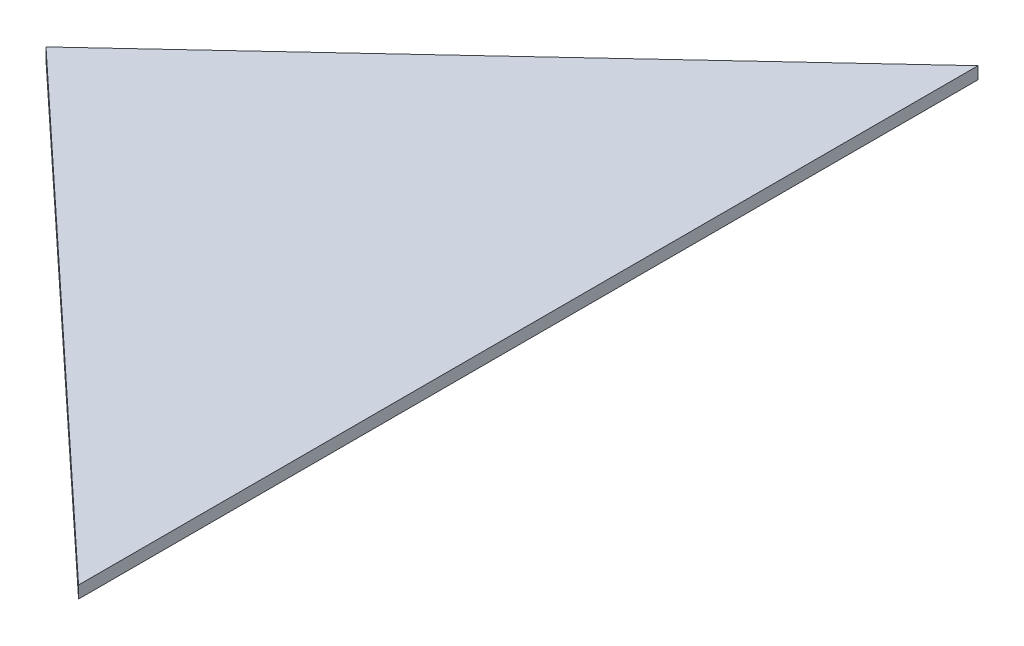
ISO-10303-21;
HEADER;
FILE_DESCRIPTION(('STEP AP214'),'2;1');
FILE_NAME('part.step','',(''),(''),'','','');
FILE_SCHEMA(('AUTOMOTIVE_DESIGN { 1 0 10303 214 1 1 1 1 }'));
ENDSEC;
DATA;
#1=APPLICATION_CONTEXT('core data for automotive mechanical design processes');
#2=APPLICATION_PROTOCOL_DEFINITION('international standard','automotive_design',2000,#1);
#3=PRODUCT_CONTEXT('',#1,'mechanical');
#4=PRODUCT('Part','Part','',(#3));
#5=PRODUCT_RELATED_PRODUCT_CATEGORY('part','',(#4));
#6=PRODUCT_DEFINITION_FORMATION('','',#4);
#7=PRODUCT_DEFINITION_CONTEXT('part definition',#1,'design');
#8=PRODUCT_DEFINITION('design','',#6,#7);
#9=PRODUCT_DEFINITION_SHAPE('','',#8);
#10=(LENGTH_UNIT() NAMED_UNIT(*) SI_UNIT(.MILLI.,.METRE.));
#11=(NAMED_UNIT(*) PLANE_ANGLE_UNIT() SI_UNIT($,.RADIAN.));
#12=(NAMED_UNIT(*) SI_UNIT($,.STERADIAN.) SOLID_ANGLE_UNIT());
#13=UNCERTAINTY_MEASURE_WITH_UNIT(LENGTH_MEASURE(1.E-05),#10,'distance_accuracy_value','');
#14=(GEOMETRIC_REPRESENTATION_CONTEXT(3) GLOBAL_UNCERTAINTY_ASSIGNED_CONTEXT((#13)) GLOBAL_UNIT_ASSIGNED_CONTEXT((#10,
#11,#12)) REPRESENTATION_CONTEXT('',''));
#15=CARTESIAN_POINT('',(0.,0.,0.));
#16=DIRECTION('',(0.,0.,1.));
#17=DIRECTION('',(1.,0.,0.));
#18=AXIS2_PLACEMENT_3D('',#15,#16,#17);
#19=CARTESIAN_POINT('',(125.390592142607,3.175,116.928618832715));
#20=DIRECTION('',(0.681998360062497,0.,-0.731353701619172));
#21=DIRECTION('',(-0.731353701619172,0.,-0.681998360062497));
#22=AXIS2_PLACEMENT_3D('',#19,#20,#21);
#23=PLANE('',#22);
#24=DIRECTION('',(0.731353701619172,0.,0.681998360062497));
#25=VECTOR('',#24,1.);
#26=CARTESIAN_POINT('',(125.390592142607,0.,116.928618832715));
#27=LINE('',#26,#25);
#28=CARTESIAN_POINT('',(0.,0.,0.));
#29=VERTEX_POINT('',#28);
#30=CARTESIAN_POINT('',(125.390592142607,0.,116.928618832715));
#31=VERTEX_POINT('',#30);
#32=EDGE_CURVE('E81',#29,#31,#27,.T.);
#33=ORIENTED_EDGE('',*,*,#32,.T.);
#34=DIRECTION('',(0.,-1.,0.));
#35=VECTOR('',#34,1.);
#36=CARTESIAN_POINT('',(125.390592142607,3.175,116.928618832715));
#37=LINE('',#36,#35);
#38=CARTESIAN_POINT('',(125.390592142607,3.175,116.928618832715));
#39=VERTEX_POINT('',#38);
#40=EDGE_CURVE('E11',#39,#31,#37,.T.);
#41=ORIENTED_EDGE('',*,*,#40,.F.);
#42=DIRECTION('',(0.731353701619172,0.,0.681998360062497));
#43=VECTOR('',#42,1.);
#44=CARTESIAN_POINT('',(125.390592142607,3.175,116.928618832715));
#45=LINE('',#44,#43);
#46=CARTESIAN_POINT('',(0.,3.175,0.));
#47=VERTEX_POINT('',#46);
#48=EDGE_CURVE('E74',#47,#39,#45,.T.);
#49=ORIENTED_EDGE('',*,*,#48,.F.);
#50=DIRECTION('',(0.,-1.,0.));
#51=VECTOR('',#50,1.);
#52=CARTESIAN_POINT('',(0.,3.175,0.));
#53=LINE('',#52,#51);
#54=EDGE_CURVE('E82',#47,#29,#53,.T.);
#55=ORIENTED_EDGE('',*,*,#54,.T.);
#56=EDGE_LOOP('',(#33,#41,#49,#55));
#57=FACE_BOUND('',#56,.T.);
#58=ADVANCED_FACE('F34',(#57),#23,.F.);
#59=CARTESIAN_POINT('',(125.390592142607,3.175,-116.928618832715));
#60=DIRECTION('',(-1.,0.,0.));
#61=DIRECTION('',(0.,0.,1.));
#62=AXIS2_PLACEMENT_3D('',#59,#60,#61);
#63=PLANE('',#62);
#64=DIRECTION('',(0.,0.,-1.));
#65=VECTOR('',#64,1.);
#66=CARTESIAN_POINT('',(125.390592142607,0.,-116.928618832715));
#67=LINE('',#66,#65);
#68=CARTESIAN_POINT('',(125.390592142607,0.,-116.928618832715));
#69=VERTEX_POINT('',#68);
#70=EDGE_CURVE('E62',#31,#69,#67,.T.);
#71=ORIENTED_EDGE('',*,*,#70,.T.);
#72=DIRECTION('',(0.,-1.,0.));
#73=VECTOR('',#72,1.);
#74=CARTESIAN_POINT('',(125.390592142607,3.175,-116.928618832715));
#75=LINE('',#74,#73);
#76=CARTESIAN_POINT('',(125.390592142607,3.175,-116.928618832715));
#77=VERTEX_POINT('',#76);
#78=EDGE_CURVE('E42',#77,#69,#75,.T.);
#79=ORIENTED_EDGE('',*,*,#78,.F.);
#80=DIRECTION('',(0.,0.,-1.));
#81=VECTOR('',#80,1.);
#82=CARTESIAN_POINT('',(125.390592142607,3.175,-116.928618832715));
#83=LINE('',#82,#81);
#84=EDGE_CURVE('E70',#39,#77,#83,.T.);
#85=ORIENTED_EDGE('',*,*,#84,.F.);
#86=ORIENTED_EDGE('',*,*,#40,.T.);
#87=EDGE_LOOP('',(#71,#79,#85,#86));
#88=FACE_BOUND('',#87,.T.);
#89=ADVANCED_FACE('F71',(#88),#63,.F.);
#90=CARTESIAN_POINT('',(0.,3.175,0.));
#91=DIRECTION('',(0.681998360062497,0.,0.731353701619171));
#92=DIRECTION('',(0.731353701619172,0.,-0.681998360062497));
#93=AXIS2_PLACEMENT_3D('',#90,#91,#92);
#94=PLANE('',#93);
#95=DIRECTION('',(-0.731353701619172,0.,0.681998360062497));
#96=VECTOR('',#95,1.);
#97=CARTESIAN_POINT('',(0.,0.,0.));
#98=LINE('',#97,#96);
#99=EDGE_CURVE('E67',#69,#29,#98,.T.);
#100=ORIENTED_EDGE('',*,*,#99,.T.);
#101=ORIENTED_EDGE('',*,*,#54,.F.);
#102=DIRECTION('',(-0.731353701619172,0.,0.681998360062497));
#103=VECTOR('',#102,1.);
#104=CARTESIAN_POINT('',(0.,3.175,0.));
#105=LINE('',#104,#103);
#106=EDGE_CURVE('E50',#77,#47,#105,.T.);
#107=ORIENTED_EDGE('',*,*,#106,.F.);
#108=ORIENTED_EDGE('',*,*,#78,.T.);
#109=EDGE_LOOP('',(#100,#101,#107,#108));
#110=FACE_BOUND('',#109,.T.);
#111=ADVANCED_FACE('F89',(#110),#94,.F.);
#112=CARTESIAN_POINT('',(0.,3.175,0.));
#113=DIRECTION('',(0.,-1.,0.));
#114=DIRECTION('',(0.,0.,-1.));
#115=AXIS2_PLACEMENT_3D('',#112,#113,#114);
#116=PLANE('',#115);
#117=ORIENTED_EDGE('',*,*,#48,.T.);
#118=ORIENTED_EDGE('',*,*,#84,.T.);
#119=ORIENTED_EDGE('',*,*,#106,.T.);
#120=EDGE_LOOP('',(#117,#118,#119));
#121=FACE_BOUND('',#120,.T.);
#122=ADVANCED_FACE('F77',(#121),#116,.F.);
#123=CARTESIAN_POINT('',(0.,0.,0.));
#124=DIRECTION('',(0.,-1.,0.));
#125=DIRECTION('',(0.,0.,-1.));
#126=AXIS2_PLACEMENT_3D('',#123,#124,#125);
#127=PLANE('',#126);
#128=ORIENTED_EDGE('',*,*,#32,.F.);
#129=ORIENTED_EDGE('',*,*,#99,.F.);
#130=ORIENTED_EDGE('',*,*,#70,.F.);
#131=EDGE_LOOP('',(#128,#129,#130));
#132=FACE_BOUND('',#131,.T.);
#133=ADVANCED_FACE('F90',(#132),#127,.T.);
#134=CLOSED_SHELL('',(#58,#89,#111,#122,#133));
#135=MANIFOLD_SOLID_BREP('B2',#134);
#136=ADVANCED_BREP_SHAPE_REPRESENTATION('',(#18,#135),#14);
#137=SHAPE_DEFINITION_REPRESENTATION(#9,#136);
ENDSEC;
END-ISO-10303-21;
